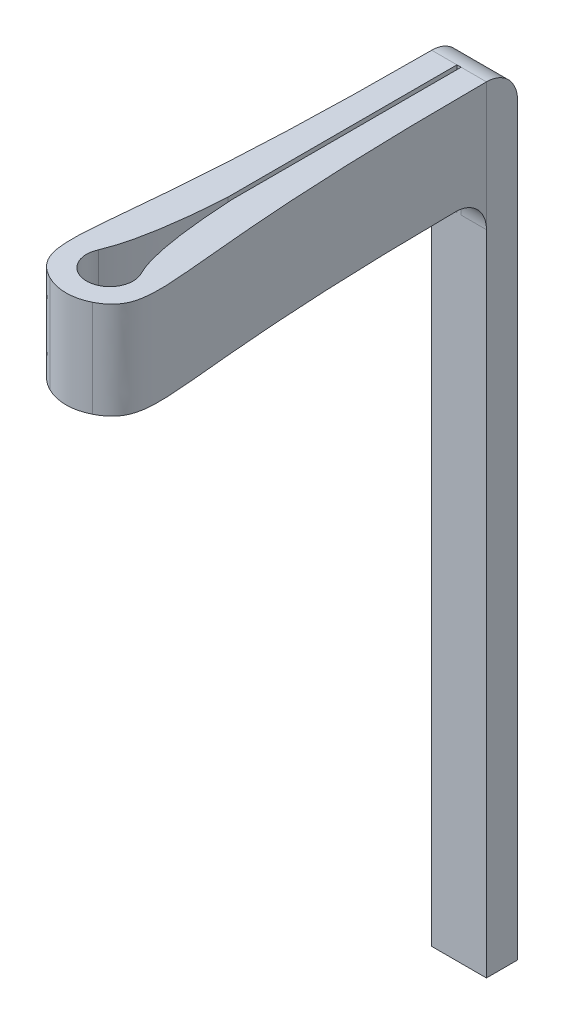
ISO-10303-21;
HEADER;
FILE_DESCRIPTION(('STEP AP214'),'2;1');
FILE_NAME('part.step','',(''),(''),'','','');
FILE_SCHEMA(('AUTOMOTIVE_DESIGN { 1 0 10303 214 1 1 1 1 }'));
ENDSEC;
DATA;
#1=APPLICATION_CONTEXT('core data for automotive mechanical design processes');
#2=APPLICATION_PROTOCOL_DEFINITION('international standard','automotive_design',2000,#1);
#3=PRODUCT_CONTEXT('',#1,'mechanical');
#4=PRODUCT('Part','Part','',(#3));
#5=PRODUCT_RELATED_PRODUCT_CATEGORY('part','',(#4));
#6=PRODUCT_DEFINITION_FORMATION('','',#4);
#7=PRODUCT_DEFINITION_CONTEXT('part definition',#1,'design');
#8=PRODUCT_DEFINITION('design','',#6,#7);
#9=PRODUCT_DEFINITION_SHAPE('','',#8);
#10=(LENGTH_UNIT() NAMED_UNIT(*) SI_UNIT(.MILLI.,.METRE.));
#11=(NAMED_UNIT(*) PLANE_ANGLE_UNIT() SI_UNIT($,.RADIAN.));
#12=(NAMED_UNIT(*) SI_UNIT($,.STERADIAN.) SOLID_ANGLE_UNIT());
#13=UNCERTAINTY_MEASURE_WITH_UNIT(LENGTH_MEASURE(1.E-05),#10,'distance_accuracy_value','');
#14=(GEOMETRIC_REPRESENTATION_CONTEXT(3) GLOBAL_UNCERTAINTY_ASSIGNED_CONTEXT((#13)) GLOBAL_UNIT_ASSIGNED_CONTEXT((#10,
#11,#12)) REPRESENTATION_CONTEXT('',''));
#15=CARTESIAN_POINT('',(0.,0.,0.));
#16=DIRECTION('',(0.,0.,1.));
#17=DIRECTION('',(1.,0.,0.));
#18=AXIS2_PLACEMENT_3D('',#15,#16,#17);
#19=CARTESIAN_POINT('',(0.895808533337032,-1.5875,-13.7148715300879));
#20=CARTESIAN_POINT('',(0.895808533337031,-1.5875,-4.54222595975247));
#21=CARTESIAN_POINT('',(1.58866877369205,-1.5875,-2.21931302735155));
#22=CARTESIAN_POINT('',(2.08819617284586,-1.5875,-1.33769603441971));
#23=CARTESIAN_POINT('',(0.,-1.5875,-0.766240153873851));
#24=B_SPLINE_CURVE_WITH_KNOTS('',4,(#19,#20,#21,#22,#23),.UNSPECIFIED.,.F.,.F.,(5,5),(0.,1.),.UNSPECIFIED.);
#25=DIRECTION('',(0.,1.,0.));
#26=VECTOR('',#25,1.);
#27=SURFACE_OF_LINEAR_EXTRUSION('',#24,#26);
#28=CARTESIAN_POINT('',(0.895808533337032,1.5875,-13.7148715300879));
#29=CARTESIAN_POINT('',(0.895808533337031,1.5875,-4.54222595975247));
#30=CARTESIAN_POINT('',(1.58866877369205,1.5875,-2.21931302735155));
#31=CARTESIAN_POINT('',(2.08819617284586,1.5875,-1.33769603441971));
#32=CARTESIAN_POINT('',(0.,1.5875,-0.766240153873851));
#33=B_SPLINE_CURVE_WITH_KNOTS('',4,(#28,#29,#30,#31,#32),.UNSPECIFIED.,.F.,.F.,(5,5),(0.,1.),.UNSPECIFIED.);
#34=CARTESIAN_POINT('',(0.895808533337032,1.5875,-13.7148715300879));
#35=VERTEX_POINT('',#34);
#36=CARTESIAN_POINT('',(0.693616128821132,1.5875,-1.02051237814192));
#37=VERTEX_POINT('',#36);
#38=EDGE_CURVE('E182',#35,#37,#33,.T.);
#39=ORIENTED_EDGE('',*,*,#38,.T.);
#40=DIRECTION('',(0.,1.,0.));
#41=VECTOR('',#40,1.);
#42=CARTESIAN_POINT('',(0.693616128821133,1.5875,-1.02051237814192));
#43=LINE('',#42,#41);
#44=CARTESIAN_POINT('',(0.693616128821132,-1.5875,-1.02051237814192));
#45=VERTEX_POINT('',#44);
#46=EDGE_CURVE('E316',#37,#45,#43,.F.);
#47=ORIENTED_EDGE('',*,*,#46,.T.);
#48=CARTESIAN_POINT('',(0.899123413075562,-1.5875,-12.6988715300887));
#49=VERTEX_POINT('',#48);
#50=EDGE_CURVE('E220',#49,#45,#24,.T.);
#51=ORIENTED_EDGE('',*,*,#50,.F.);
#52=CARTESIAN_POINT('',(0.899123413084522,-1.5875,-12.6988715300879));
#53=CARTESIAN_POINT('',(0.898933128711052,-1.58750020345704,-12.7274556913153));
#54=CARTESIAN_POINT('',(0.898751550135297,-1.588707043984,-12.7560262069104));
#55=CARTESIAN_POINT('',(0.898406314253751,-1.59352166634173,-12.8129629464484));
#56=CARTESIAN_POINT('',(0.898242656112615,-1.59712933620436,-12.8413291798562));
#57=CARTESIAN_POINT('',(0.897779810976951,-1.61151941722774,-12.9257670168045));
#58=CARTESIAN_POINT('',(0.897508122225242,-1.62586899450502,-12.9812732267905));
#59=CARTESIAN_POINT('',(0.897037413433582,-1.66368223177585,-13.0890872621627));
#60=CARTESIAN_POINT('',(0.896838428424054,-1.68715027405968,-13.1413935356636));
#61=CARTESIAN_POINT('',(0.896505476626066,-1.74253414258107,-13.2413232897363));
#62=CARTESIAN_POINT('',(0.896371498383278,-1.77444847903125,-13.2889475941009));
#63=CARTESIAN_POINT('',(0.896156730382232,-1.84581454495091,-13.3781613587182));
#64=CARTESIAN_POINT('',(0.896075945195192,-1.88526692183634,-13.4197503000745));
#65=CARTESIAN_POINT('',(0.895953480385962,-1.97061995173144,-13.4957270318787));
#66=CARTESIAN_POINT('',(0.895911800135447,-2.01652050112037,-13.5301149380236));
#67=CARTESIAN_POINT('',(0.89586807991464,-2.08917779055579,-13.5755407561251));
#68=CARTESIAN_POINT('',(0.895856638218661,-2.11405325433365,-13.5896657358438));
#69=CARTESIAN_POINT('',(0.895838452615409,-2.16488028841855,-13.6157599986209));
#70=CARTESIAN_POINT('',(0.895831704538102,-2.19083088175075,-13.6277311881789));
#71=CARTESIAN_POINT('',(0.895816263451206,-2.27005515466774,-13.6602878609003));
#72=CARTESIAN_POINT('',(0.895812349793979,-2.32475190267935,-13.6775480073459));
#73=CARTESIAN_POINT('',(0.895809171928931,-2.41706043780761,-13.6983260460475));
#74=CARTESIAN_POINT('',(0.895808773736024,-2.45410086402192,-13.7045265647462));
#75=CARTESIAN_POINT('',(0.895808530960212,-2.52858669157816,-13.7127976228349));
#76=CARTESIAN_POINT('',(0.895808685591698,-2.56603144290336,-13.7148740164188));
#77=CARTESIAN_POINT('',(0.895808533337032,-2.6035,-13.7148715300879));
#78=B_SPLINE_CURVE_WITH_KNOTS('',3,(#52,#53,#54,#55,#56,#57,#58,#59,#60,#61,#62,#63,#64,#65,#66,
#67,#68,#69,#70,#71,#72,#73,#74,#75,#76,#77),.UNSPECIFIED.,.F.,.F.,(4,2,2,2,2,2,2,2,2,2,2,2,4),
(0.,0.0857016931933246,0.171399389773151,0.34251201259806,0.513706973244693,0.684871758017355,
0.856051250148908,1.02722799177784,1.11295702741115,1.19860979969476,1.36973870794013,
1.48219984882806,1.59450123675989),.UNSPECIFIED.);
#79=CARTESIAN_POINT('',(0.895808533337032,-2.6035,-13.7148715300879));
#80=VERTEX_POINT('',#79);
#81=EDGE_CURVE('E365',#49,#80,#78,.T.);
#82=ORIENTED_EDGE('',*,*,#81,.T.);
#83=DIRECTION('',(0.,1.,0.));
#84=VECTOR('',#83,1.);
#85=CARTESIAN_POINT('',(0.895808533337032,-1.5875,-13.7148715300879));
#86=LINE('',#85,#84);
#87=EDGE_CURVE('E56',#80,#35,#86,.T.);
#88=ORIENTED_EDGE('',*,*,#87,.T.);
#89=EDGE_LOOP('',(#39,#47,#51,#82,#88));
#90=FACE_BOUND('',#89,.T.);
#91=ADVANCED_FACE('F35',(#90),#27,.F.);
#92=CARTESIAN_POINT('',(-0.895808533337031,-1.5875,-13.7148715300879));
#93=CARTESIAN_POINT('',(-0.895808533337032,-1.5875,-4.54222595975247));
#94=CARTESIAN_POINT('',(-1.58866877369205,-1.5875,-2.21931302735155));
#95=CARTESIAN_POINT('',(-2.08819617284586,-1.5875,-1.33769603441971));
#96=CARTESIAN_POINT('',(0.,-1.5875,-0.766240153873851));
#97=B_SPLINE_CURVE_WITH_KNOTS('',4,(#92,#93,#94,#95,#96),.UNSPECIFIED.,.F.,.F.,(5,5),(0.,1.),.UNSPECIFIED.);
#98=DIRECTION('',(0.,1.,0.));
#99=VECTOR('',#98,1.);
#100=SURFACE_OF_LINEAR_EXTRUSION('',#97,#99);
#101=DIRECTION('',(0.,1.,0.));
#102=VECTOR('',#101,1.);
#103=CARTESIAN_POINT('',(-0.895808533337031,-1.5875,-13.7148715300879));
#104=LINE('',#103,#102);
#105=CARTESIAN_POINT('',(-0.895808533337031,-2.6035,-13.7148715300879));
#106=VERTEX_POINT('',#105);
#107=CARTESIAN_POINT('',(-0.895808533337031,1.5875,-13.7148715300879));
#108=VERTEX_POINT('',#107);
#109=EDGE_CURVE('E339',#106,#108,#104,.T.);
#110=ORIENTED_EDGE('',*,*,#109,.F.);
#111=CARTESIAN_POINT('',(-0.895808533337031,-2.6035,-13.7148715300879));
#112=CARTESIAN_POINT('',(-0.895808577092861,-2.57491510973712,-13.7148713264985));
#113=CARTESIAN_POINT('',(-0.895808528511462,-2.54634392472514,-13.7136644246977));
#114=CARTESIAN_POINT('',(-0.895808618861333,-2.48940597123118,-13.7088495859276));
#115=CARTESIAN_POINT('',(-0.895808757783834,-2.46103919325167,-13.7052417612511));
#116=CARTESIAN_POINT('',(-0.895810012620951,-2.37659991581095,-13.6908511195006));
#117=CARTESIAN_POINT('',(-0.895811964296557,-2.32109299299045,-13.6765010398288));
#118=CARTESIAN_POINT('',(-0.895825408633093,-2.21327798056724,-13.6386867257066));
#119=CARTESIAN_POINT('',(-0.89583690587852,-2.16097144099123,-13.6152181147369));
#120=CARTESIAN_POINT('',(-0.895880803790064,-2.06104143824503,-13.5598331272013));
#121=CARTESIAN_POINT('',(-0.895913200775506,-2.01341715218015,-13.5279182387011));
#122=CARTESIAN_POINT('',(-0.896012599209308,-1.92420325438186,-13.4565508369797));
#123=CARTESIAN_POINT('',(-0.896079603922931,-1.88261421255246,-13.4170976127324));
#124=CARTESIAN_POINT('',(-0.896262655081279,-1.80663757824133,-13.3317429175017));
#125=CARTESIAN_POINT('',(-0.896378700732181,-1.77224986920574,-13.2858415509017));
#126=CARTESIAN_POINT('',(-0.896598868812494,-1.72682476343896,-13.2131834856075));
#127=CARTESIAN_POINT('',(-0.89668002622306,-1.71270016513127,-13.1883080182779));
#128=CARTESIAN_POINT('',(-0.896858870784934,-1.68660666976522,-13.1374810649115));
#129=CARTESIAN_POINT('',(-0.896956543167485,-1.67463586621497,-13.1115305557651));
#130=CARTESIAN_POINT('',(-0.89727611608098,-1.64208033890623,-13.0323066807575));
#131=CARTESIAN_POINT('',(-0.897524718601109,-1.62482094452539,-12.9776103988227));
#132=CARTESIAN_POINT('',(-0.897997890996059,-1.60404416344566,-12.8853037582438));
#133=CARTESIAN_POINT('',(-0.898201479605004,-1.5978441225871,-12.848264630884));
#134=CARTESIAN_POINT('',(-0.898639493602371,-1.58957372507961,-12.7737816456367));
#135=CARTESIAN_POINT('',(-0.8988738747654,-1.58749751329236,-12.736338437585));
#136=CARTESIAN_POINT('',(-0.899123413075567,-1.5875,-12.6988715300878));
#137=B_SPLINE_CURVE_WITH_KNOTS('',3,(#111,#112,#113,#114,#115,#116,#117,#118,#119,#120,#121,
#122,#123,#124,#125,#126,#127,#128,#129,#130,#131,#132,#133,#134,#135,#136),.UNSPECIFIED.,.F.,
.F.,(4,2,2,2,2,2,2,2,2,2,2,2,4),(0.,0.0857019762667672,0.171399944476704,0.342513086760776,
0.513708457954163,0.684873687991979,0.856055070543598,1.02723368230345,1.11296249946954,
1.19861505396577,1.36974355203272,1.48220228529057,1.59450123174176),.UNSPECIFIED.);
#138=CARTESIAN_POINT('',(-0.899123413075567,-1.5875,-12.6988715300878));
#139=VERTEX_POINT('',#138);
#140=EDGE_CURVE('E11',#106,#139,#137,.T.);
#141=ORIENTED_EDGE('',*,*,#140,.T.);
#142=CARTESIAN_POINT('',(-0.693616128821139,-1.5875,-1.02051237814192));
#143=VERTEX_POINT('',#142);
#144=EDGE_CURVE('E243',#139,#143,#97,.T.);
#145=ORIENTED_EDGE('',*,*,#144,.T.);
#146=DIRECTION('',(0.,1.,0.));
#147=VECTOR('',#146,1.);
#148=CARTESIAN_POINT('',(-0.693616128821141,-1.5875,-1.02051237814192));
#149=LINE('',#148,#147);
#150=CARTESIAN_POINT('',(-0.693616128821139,1.5875,-1.02051237814192));
#151=VERTEX_POINT('',#150);
#152=EDGE_CURVE('E331',#143,#151,#149,.T.);
#153=ORIENTED_EDGE('',*,*,#152,.T.);
#154=CARTESIAN_POINT('',(-0.895808533337031,1.5875,-13.7148715300879));
#155=CARTESIAN_POINT('',(-0.895808533337032,1.5875,-4.54222595975247));
#156=CARTESIAN_POINT('',(-1.58866877369205,1.5875,-2.21931302735155));
#157=CARTESIAN_POINT('',(-2.08819617284586,1.5875,-1.33769603441971));
#158=CARTESIAN_POINT('',(0.,1.5875,-0.766240153873851));
#159=B_SPLINE_CURVE_WITH_KNOTS('',4,(#154,#155,#156,#157,#158),.UNSPECIFIED.,.F.,.F.,(5,5),(0.,
1.),.UNSPECIFIED.);
#160=EDGE_CURVE('E215',#108,#151,#159,.T.);
#161=ORIENTED_EDGE('',*,*,#160,.F.);
#162=EDGE_LOOP('',(#110,#141,#145,#153,#161));
#163=FACE_BOUND('',#162,.T.);
#164=ADVANCED_FACE('F261',(#163),#100,.T.);
#165=CARTESIAN_POINT('',(-0.0682967636124148,-1.5875,0.));
#166=DIRECTION('',(-1.,0.,0.));
#167=DIRECTION('',(0.,0.,1.));
#168=AXIS2_PLACEMENT_3D('',#165,#166,#167);
#169=PLANE('',#168);
#170=DIRECTION('',(0.,1.,0.));
#171=VECTOR('',#170,1.);
#172=CARTESIAN_POINT('',(-0.0682967636124164,-1.5875,-13.7148715300879));
#173=LINE('',#172,#171);
#174=CARTESIAN_POINT('',(-0.0682967636124164,-2.6035,-13.7148715300879));
#175=VERTEX_POINT('',#174);
#176=CARTESIAN_POINT('',(-0.0682967636124159,1.5875,-13.7148715300879));
#177=VERTEX_POINT('',#176);
#178=EDGE_CURVE('E255',#175,#177,#173,.T.);
#179=ORIENTED_EDGE('',*,*,#178,.T.);
#180=DIRECTION('',(0.,0.,1.));
#181=VECTOR('',#180,1.);
#182=CARTESIAN_POINT('',(-0.0682967636124148,1.5875,0.));
#183=LINE('',#182,#181);
#184=CARTESIAN_POINT('',(-0.0682967636124155,1.5875,-6.21461869480893));
#185=VERTEX_POINT('',#184);
#186=EDGE_CURVE('E209',#177,#185,#183,.T.);
#187=ORIENTED_EDGE('',*,*,#186,.T.);
#188=DIRECTION('',(0.,1.,0.));
#189=VECTOR('',#188,1.);
#190=CARTESIAN_POINT('',(-0.0682967636124155,-1.5875,-6.21461869480893));
#191=LINE('',#190,#189);
#192=CARTESIAN_POINT('',(-0.0682967636124155,-1.5875,-6.21461869480893));
#193=VERTEX_POINT('',#192);
#194=EDGE_CURVE('E392',#193,#185,#191,.T.);
#195=ORIENTED_EDGE('',*,*,#194,.F.);
#196=DIRECTION('',(0.,0.,1.));
#197=VECTOR('',#196,1.);
#198=CARTESIAN_POINT('',(-0.0682967636124148,-1.5875,0.));
#199=LINE('',#198,#197);
#200=CARTESIAN_POINT('',(-0.0682967636124163,-1.5875,-12.6988715300879));
#201=VERTEX_POINT('',#200);
#202=EDGE_CURVE('E246',#201,#193,#199,.T.);
#203=ORIENTED_EDGE('',*,*,#202,.F.);
#204=CARTESIAN_POINT('',(-0.0682967636124163,-2.6035,-12.6988715300879));
#205=DIRECTION('',(-1.,0.,0.));
#206=DIRECTION('',(0.,0.,1.));
#207=AXIS2_PLACEMENT_3D('',#204,#205,#206);
#208=CIRCLE('',#207,1.016);
#209=EDGE_CURVE('E49',#201,#175,#208,.T.);
#210=ORIENTED_EDGE('',*,*,#209,.T.);
#211=EDGE_LOOP('',(#179,#187,#195,#203,#210));
#212=FACE_BOUND('',#211,.T.);
#213=ADVANCED_FACE('F266',(#212),#169,.F.);
#214=CARTESIAN_POINT('',(-0.69080742229309,-1.5875,-2.60647548731597));
#215=CARTESIAN_POINT('',(-0.217222133422871,-1.5875,-3.73873423608694));
#216=CARTESIAN_POINT('',(-0.0682967636124155,-1.5875,-6.21461869480893));
#217=B_SPLINE_CURVE_WITH_KNOTS('',2,(#214,#215,#216),.UNSPECIFIED.,.F.,.F.,(3,3),(0.,1.),.UNSPECIFIED.);
#218=DIRECTION('',(0.,1.,0.));
#219=VECTOR('',#218,1.);
#220=SURFACE_OF_LINEAR_EXTRUSION('',#217,#219);
#221=ORIENTED_EDGE('',*,*,#194,.T.);
#222=CARTESIAN_POINT('',(-0.69080742229309,1.5875,-2.60647548731597));
#223=CARTESIAN_POINT('',(-0.217222133422871,1.5875,-3.73873423608694));
#224=CARTESIAN_POINT('',(-0.0682967636124155,1.5875,-6.21461869480893));
#225=B_SPLINE_CURVE_WITH_KNOTS('',2,(#222,#223,#224),.UNSPECIFIED.,.F.,.F.,(3,3),(0.,1.),.UNSPECIFIED.);
#226=CARTESIAN_POINT('',(-0.69080742229309,1.5875,-2.60647548731597));
#227=VERTEX_POINT('',#226);
#228=EDGE_CURVE('E204',#227,#185,#225,.T.);
#229=ORIENTED_EDGE('',*,*,#228,.F.);
#230=DIRECTION('',(0.,1.,0.));
#231=VECTOR('',#230,1.);
#232=CARTESIAN_POINT('',(-0.69080742229309,-1.5875,-2.60647548731597));
#233=LINE('',#232,#231);
#234=CARTESIAN_POINT('',(-0.69080742229309,-1.5875,-2.60647548731597));
#235=VERTEX_POINT('',#234);
#236=EDGE_CURVE('E391',#235,#227,#233,.T.);
#237=ORIENTED_EDGE('',*,*,#236,.F.);
#238=EDGE_CURVE('E279',#235,#193,#217,.T.);
#239=ORIENTED_EDGE('',*,*,#238,.T.);
#240=EDGE_LOOP('',(#221,#229,#237,#239));
#241=FACE_BOUND('',#240,.T.);
#242=ADVANCED_FACE('F272',(#241),#220,.T.);
#243=CARTESIAN_POINT('',(0.,-1.5875,-2.28487153008787));
#244=DIRECTION('',(0.,1.,0.));
#245=DIRECTION('',(0.,0.,1.));
#246=AXIS2_PLACEMENT_3D('',#243,#244,#245);
#247=CYLINDRICAL_SURFACE('',#246,0.762);
#248=ORIENTED_EDGE('',*,*,#236,.T.);
#249=CARTESIAN_POINT('',(0.,1.5875,-2.28487153008787));
#250=DIRECTION('',(0.,1.,0.));
#251=DIRECTION('',(0.,0.,1.));
#252=AXIS2_PLACEMENT_3D('',#249,#250,#251);
#253=CIRCLE('',#252,0.762);
#254=CARTESIAN_POINT('',(0.69080742229309,1.5875,-2.60647548731597));
#255=VERTEX_POINT('',#254);
#256=EDGE_CURVE('E198',#227,#255,#253,.T.);
#257=ORIENTED_EDGE('',*,*,#256,.T.);
#258=DIRECTION('',(0.,1.,0.));
#259=VECTOR('',#258,1.);
#260=CARTESIAN_POINT('',(0.69080742229309,-1.5875,-2.60647548731597));
#261=LINE('',#260,#259);
#262=CARTESIAN_POINT('',(0.69080742229309,-1.5875,-2.60647548731597));
#263=VERTEX_POINT('',#262);
#264=EDGE_CURVE('E389',#263,#255,#261,.T.);
#265=ORIENTED_EDGE('',*,*,#264,.F.);
#266=CARTESIAN_POINT('',(0.,-1.5875,-2.28487153008787));
#267=DIRECTION('',(0.,1.,0.));
#268=DIRECTION('',(0.,0.,1.));
#269=AXIS2_PLACEMENT_3D('',#266,#267,#268);
#270=CIRCLE('',#269,0.762);
#271=EDGE_CURVE('E285',#235,#263,#270,.T.);
#272=ORIENTED_EDGE('',*,*,#271,.F.);
#273=EDGE_LOOP('',(#248,#257,#265,#272));
#274=FACE_BOUND('',#273,.T.);
#275=ADVANCED_FACE('F276',(#274),#247,.F.);
#276=CARTESIAN_POINT('',(0.69080742229309,-1.5875,-2.60647548731597));
#277=CARTESIAN_POINT('',(0.218071276463601,-1.5875,-3.48213292446278));
#278=CARTESIAN_POINT('',(0.0682967636124155,-1.5875,-6.21461869480893));
#279=B_SPLINE_CURVE_WITH_KNOTS('',2,(#276,#277,#278),.UNSPECIFIED.,.F.,.F.,(3,3),(0.,1.),.UNSPECIFIED.);
#280=DIRECTION('',(0.,1.,0.));
#281=VECTOR('',#280,1.);
#282=SURFACE_OF_LINEAR_EXTRUSION('',#279,#281);
#283=ORIENTED_EDGE('',*,*,#264,.T.);
#284=CARTESIAN_POINT('',(0.69080742229309,1.5875,-2.60647548731597));
#285=CARTESIAN_POINT('',(0.218071276463601,1.5875,-3.48213292446278));
#286=CARTESIAN_POINT('',(0.0682967636124155,1.5875,-6.21461869480893));
#287=B_SPLINE_CURVE_WITH_KNOTS('',2,(#284,#285,#286),.UNSPECIFIED.,.F.,.F.,(3,3),(0.,1.),.UNSPECIFIED.);
#288=CARTESIAN_POINT('',(0.0682967636124155,1.5875,-6.21461869480893));
#289=VERTEX_POINT('',#288);
#290=EDGE_CURVE('E193',#255,#289,#287,.T.);
#291=ORIENTED_EDGE('',*,*,#290,.T.);
#292=DIRECTION('',(0.,1.,0.));
#293=VECTOR('',#292,1.);
#294=CARTESIAN_POINT('',(0.0682967636124155,-1.5875,-6.21461869480893));
#295=LINE('',#294,#293);
#296=CARTESIAN_POINT('',(0.0682967636124155,-1.5875,-6.21461869480893));
#297=VERTEX_POINT('',#296);
#298=EDGE_CURVE('E387',#297,#289,#295,.T.);
#299=ORIENTED_EDGE('',*,*,#298,.F.);
#300=EDGE_CURVE('E289',#263,#297,#279,.T.);
#301=ORIENTED_EDGE('',*,*,#300,.F.);
#302=EDGE_LOOP('',(#283,#291,#299,#301));
#303=FACE_BOUND('',#302,.T.);
#304=ADVANCED_FACE('F297',(#303),#282,.F.);
#305=CARTESIAN_POINT('',(0.0682967636124148,-1.5875,0.));
#306=DIRECTION('',(-1.,0.,0.));
#307=DIRECTION('',(0.,0.,1.));
#308=AXIS2_PLACEMENT_3D('',#305,#306,#307);
#309=PLANE('',#308);
#310=ORIENTED_EDGE('',*,*,#298,.T.);
#311=DIRECTION('',(0.,0.,1.));
#312=VECTOR('',#311,1.);
#313=CARTESIAN_POINT('',(0.0682967636124148,1.5875,0.));
#314=LINE('',#313,#312);
#315=CARTESIAN_POINT('',(0.0682967636124164,1.5875,-13.7148715300879));
#316=VERTEX_POINT('',#315);
#317=EDGE_CURVE('E187',#316,#289,#314,.T.);
#318=ORIENTED_EDGE('',*,*,#317,.F.);
#319=DIRECTION('',(0.,1.,0.));
#320=VECTOR('',#319,1.);
#321=CARTESIAN_POINT('',(0.0682967636124164,-1.5875,-13.7148715300879));
#322=LINE('',#321,#320);
#323=CARTESIAN_POINT('',(0.0682967636124164,-2.6035,-13.7148715300879));
#324=VERTEX_POINT('',#323);
#325=EDGE_CURVE('E336',#324,#316,#322,.T.);
#326=ORIENTED_EDGE('',*,*,#325,.F.);
#327=CARTESIAN_POINT('',(0.0682967636124163,-2.6035,-12.6988715300879));
#328=DIRECTION('',(-1.,0.,0.));
#329=DIRECTION('',(0.,0.,1.));
#330=AXIS2_PLACEMENT_3D('',#327,#328,#329);
#331=CIRCLE('',#330,1.016);
#332=CARTESIAN_POINT('',(0.0682967636124163,-1.5875,-12.6988715300879));
#333=VERTEX_POINT('',#332);
#334=EDGE_CURVE('E363',#324,#333,#331,.F.);
#335=ORIENTED_EDGE('',*,*,#334,.T.);
#336=DIRECTION('',(0.,0.,1.));
#337=VECTOR('',#336,1.);
#338=CARTESIAN_POINT('',(0.0682967636124148,-1.5875,0.));
#339=LINE('',#338,#337);
#340=EDGE_CURVE('E228',#333,#297,#339,.T.);
#341=ORIENTED_EDGE('',*,*,#340,.T.);
#342=EDGE_LOOP('',(#310,#318,#326,#335,#341));
#343=FACE_BOUND('',#342,.T.);
#344=ADVANCED_FACE('F299',(#343),#309,.T.);
#345=CARTESIAN_POINT('',(0.,-1.5875,0.));
#346=DIRECTION('',(0.,1.,0.));
#347=DIRECTION('',(0.,0.,1.));
#348=AXIS2_PLACEMENT_3D('',#345,#346,#347);
#349=PLANE('',#348);
#350=ORIENTED_EDGE('',*,*,#340,.F.);
#351=DIRECTION('',(-1.,0.,0.));
#352=VECTOR('',#351,1.);
#353=CARTESIAN_POINT('',(0.,-1.5875,-12.6988715300879));
#354=LINE('',#353,#352);
#355=EDGE_CURVE('E346',#333,#49,#354,.F.);
#356=ORIENTED_EDGE('',*,*,#355,.T.);
#357=ORIENTED_EDGE('',*,*,#50,.T.);
#358=CARTESIAN_POINT('',(0.,-1.5875,-2.37752109802517));
#359=DIRECTION('',(0.,1.,0.));
#360=DIRECTION('',(0.,0.,1.));
#361=AXIS2_PLACEMENT_3D('',#358,#359,#360);
#362=CIRCLE('',#361,1.524);
#363=EDGE_CURVE('E328',#45,#143,#362,.F.);
#364=ORIENTED_EDGE('',*,*,#363,.T.);
#365=ORIENTED_EDGE('',*,*,#144,.F.);
#366=DIRECTION('',(1.,0.,0.));
#367=VECTOR('',#366,1.);
#368=CARTESIAN_POINT('',(0.,-1.5875,-12.6988715300879));
#369=LINE('',#368,#367);
#370=EDGE_CURVE('E247',#139,#201,#369,.T.);
#371=ORIENTED_EDGE('',*,*,#370,.T.);
#372=ORIENTED_EDGE('',*,*,#202,.T.);
#373=ORIENTED_EDGE('',*,*,#238,.F.);
#374=ORIENTED_EDGE('',*,*,#271,.T.);
#375=ORIENTED_EDGE('',*,*,#300,.T.);
#376=EDGE_LOOP('',(#350,#356,#357,#364,#365,#371,#372,#373,#374,#375));
#377=FACE_BOUND('',#376,.T.);
#378=ADVANCED_FACE('F268',(#377),#349,.F.);
#379=CARTESIAN_POINT('',(0.,1.5875,0.));
#380=DIRECTION('',(0.,1.,0.));
#381=DIRECTION('',(0.,0.,1.));
#382=AXIS2_PLACEMENT_3D('',#379,#380,#381);
#383=PLANE('',#382);
#384=ORIENTED_EDGE('',*,*,#38,.F.);
#385=DIRECTION('',(-1.,0.,0.));
#386=VECTOR('',#385,1.);
#387=CARTESIAN_POINT('',(0.,1.5875,-13.7148715300879));
#388=LINE('',#387,#386);
#389=EDGE_CURVE('E353',#35,#316,#388,.T.);
#390=ORIENTED_EDGE('',*,*,#389,.T.);
#391=ORIENTED_EDGE('',*,*,#317,.T.);
#392=ORIENTED_EDGE('',*,*,#290,.F.);
#393=ORIENTED_EDGE('',*,*,#256,.F.);
#394=ORIENTED_EDGE('',*,*,#228,.T.);
#395=ORIENTED_EDGE('',*,*,#186,.F.);
#396=DIRECTION('',(-1.,0.,0.));
#397=VECTOR('',#396,1.);
#398=CARTESIAN_POINT('',(0.,1.5875,-13.7148715300879));
#399=LINE('',#398,#397);
#400=EDGE_CURVE('E350',#177,#108,#399,.T.);
#401=ORIENTED_EDGE('',*,*,#400,.T.);
#402=ORIENTED_EDGE('',*,*,#160,.T.);
#403=CARTESIAN_POINT('',(0.,1.5875,-2.37752109802517));
#404=DIRECTION('',(0.,1.,0.));
#405=DIRECTION('',(0.,0.,1.));
#406=AXIS2_PLACEMENT_3D('',#403,#404,#405);
#407=CIRCLE('',#406,1.524);
#408=EDGE_CURVE('E325',#151,#37,#407,.T.);
#409=ORIENTED_EDGE('',*,*,#408,.T.);
#410=EDGE_LOOP('',(#384,#390,#391,#392,#393,#394,#395,#401,#402,#409));
#411=FACE_BOUND('',#410,.T.);
#412=ADVANCED_FACE('F306',(#411),#383,.T.);
#413=CARTESIAN_POINT('',(0.,0.,-2.37752109802517));
#414=DIRECTION('',(0.,1.,0.));
#415=DIRECTION('',(0.,0.,1.));
#416=AXIS2_PLACEMENT_3D('',#413,#414,#415);
#417=CYLINDRICAL_SURFACE('',#416,1.524);
#418=ORIENTED_EDGE('',*,*,#363,.F.);
#419=ORIENTED_EDGE('',*,*,#46,.F.);
#420=ORIENTED_EDGE('',*,*,#408,.F.);
#421=ORIENTED_EDGE('',*,*,#152,.F.);
#422=EDGE_LOOP('',(#418,#419,#420,#421));
#423=FACE_BOUND('',#422,.T.);
#424=ADVANCED_FACE('F323',(#423),#417,.T.);
#425=CARTESIAN_POINT('',(0.895808533337032,0.,-13.7148715300879));
#426=DIRECTION('',(0.,0.,1.));
#427=DIRECTION('',(1.,0.,0.));
#428=AXIS2_PLACEMENT_3D('',#425,#426,#427);
#429=PLANE('',#428);
#430=DIRECTION('',(0.,1.,0.));
#431=VECTOR('',#430,1.);
#432=CARTESIAN_POINT('',(0.895808533337032,0.,-13.7148715300879));
#433=LINE('',#432,#431);
#434=CARTESIAN_POINT('',(0.895808533337032,-23.8125,-13.7148715300879));
#435=VERTEX_POINT('',#434);
#436=EDGE_CURVE('E170',#435,#80,#433,.T.);
#437=ORIENTED_EDGE('',*,*,#436,.T.);
#438=DIRECTION('',(-1.,0.,0.));
#439=VECTOR('',#438,1.);
#440=CARTESIAN_POINT('',(0.895808533337032,-2.6035,-13.7148715300879));
#441=LINE('',#440,#439);
#442=EDGE_CURVE('E241',#80,#324,#441,.T.);
#443=ORIENTED_EDGE('',*,*,#442,.T.);
#444=ORIENTED_EDGE('',*,*,#325,.T.);
#445=DIRECTION('',(-1.,0.,0.));
#446=VECTOR('',#445,1.);
#447=CARTESIAN_POINT('',(0.895808533337032,1.5875,-13.7148715300879));
#448=LINE('',#447,#446);
#449=EDGE_CURVE('E151',#316,#177,#448,.T.);
#450=ORIENTED_EDGE('',*,*,#449,.T.);
#451=ORIENTED_EDGE('',*,*,#178,.F.);
#452=DIRECTION('',(1.,0.,0.));
#453=VECTOR('',#452,1.);
#454=CARTESIAN_POINT('',(0.895808533337032,-2.6035,-13.7148715300879));
#455=LINE('',#454,#453);
#456=EDGE_CURVE('E159',#175,#106,#455,.F.);
#457=ORIENTED_EDGE('',*,*,#456,.T.);
#458=DIRECTION('',(0.,1.,0.));
#459=VECTOR('',#458,1.);
#460=CARTESIAN_POINT('',(-0.895808533337031,0.,-13.7148715300879));
#461=LINE('',#460,#459);
#462=CARTESIAN_POINT('',(-0.895808533337031,-23.8125,-13.7148715300879));
#463=VERTEX_POINT('',#462);
#464=EDGE_CURVE('E156',#463,#106,#461,.T.);
#465=ORIENTED_EDGE('',*,*,#464,.F.);
#466=DIRECTION('',(-1.,0.,0.));
#467=VECTOR('',#466,1.);
#468=CARTESIAN_POINT('',(0.895808533337032,-23.8125,-13.7148715300879));
#469=LINE('',#468,#467);
#470=EDGE_CURVE('E142',#435,#463,#469,.T.);
#471=ORIENTED_EDGE('',*,*,#470,.F.);
#472=EDGE_LOOP('',(#437,#443,#444,#450,#451,#457,#465,#471));
#473=FACE_BOUND('',#472,.T.);
#474=ADVANCED_FACE('F157',(#473),#429,.T.);
#475=CARTESIAN_POINT('',(0.895808533337032,0.,-14.7308715300879));
#476=DIRECTION('',(0.,0.,-1.));
#477=DIRECTION('',(0.,1.,0.));
#478=AXIS2_PLACEMENT_3D('',#475,#476,#477);
#479=PLANE('',#478);
#480=DIRECTION('',(0.,-1.,0.));
#481=VECTOR('',#480,1.);
#482=CARTESIAN_POINT('',(-0.895808533337031,0.,-14.7308715300879));
#483=LINE('',#482,#481);
#484=CARTESIAN_POINT('',(-0.895808533337031,0.5715,-14.7308715300879));
#485=VERTEX_POINT('',#484);
#486=CARTESIAN_POINT('',(-0.895808533337031,-23.8125,-14.7308715300879));
#487=VERTEX_POINT('',#486);
#488=EDGE_CURVE('E163',#485,#487,#483,.T.);
#489=ORIENTED_EDGE('',*,*,#488,.F.);
#490=DIRECTION('',(-1.,0.,0.));
#491=VECTOR('',#490,1.);
#492=CARTESIAN_POINT('',(0.895808533337032,0.5715,-14.7308715300879));
#493=LINE('',#492,#491);
#494=CARTESIAN_POINT('',(0.895808533337032,0.5715,-14.7308715300879));
#495=VERTEX_POINT('',#494);
#496=EDGE_CURVE('E359',#485,#495,#493,.F.);
#497=ORIENTED_EDGE('',*,*,#496,.T.);
#498=DIRECTION('',(0.,-1.,0.));
#499=VECTOR('',#498,1.);
#500=CARTESIAN_POINT('',(0.895808533337032,0.,-14.7308715300879));
#501=LINE('',#500,#499);
#502=CARTESIAN_POINT('',(0.895808533337032,-23.8125,-14.7308715300879));
#503=VERTEX_POINT('',#502);
#504=EDGE_CURVE('E168',#495,#503,#501,.T.);
#505=ORIENTED_EDGE('',*,*,#504,.T.);
#506=DIRECTION('',(-1.,0.,0.));
#507=VECTOR('',#506,1.);
#508=CARTESIAN_POINT('',(0.895808533337032,-23.8125,-14.7308715300879));
#509=LINE('',#508,#507);
#510=EDGE_CURVE('E152',#503,#487,#509,.T.);
#511=ORIENTED_EDGE('',*,*,#510,.T.);
#512=EDGE_LOOP('',(#489,#497,#505,#511));
#513=FACE_BOUND('',#512,.T.);
#514=ADVANCED_FACE('F404',(#513),#479,.T.);
#515=CARTESIAN_POINT('',(0.895808533337032,-23.8125,0.));
#516=DIRECTION('',(0.,1.,0.));
#517=DIRECTION('',(0.,0.,1.));
#518=AXIS2_PLACEMENT_3D('',#515,#516,#517);
#519=PLANE('',#518);
#520=ORIENTED_EDGE('',*,*,#470,.T.);
#521=DIRECTION('',(0.,0.,-1.));
#522=VECTOR('',#521,1.);
#523=CARTESIAN_POINT('',(-0.895808533337031,-23.8125,0.));
#524=LINE('',#523,#522);
#525=EDGE_CURVE('E147',#463,#487,#524,.T.);
#526=ORIENTED_EDGE('',*,*,#525,.T.);
#527=ORIENTED_EDGE('',*,*,#510,.F.);
#528=DIRECTION('',(0.,0.,-1.));
#529=VECTOR('',#528,1.);
#530=CARTESIAN_POINT('',(0.895808533337032,-23.8125,0.));
#531=LINE('',#530,#529);
#532=EDGE_CURVE('E149',#435,#503,#531,.T.);
#533=ORIENTED_EDGE('',*,*,#532,.F.);
#534=EDGE_LOOP('',(#520,#526,#527,#533));
#535=FACE_BOUND('',#534,.T.);
#536=ADVANCED_FACE('F144',(#535),#519,.F.);
#537=CARTESIAN_POINT('',(0.895808533337032,0.,0.));
#538=DIRECTION('',(1.,0.,0.));
#539=DIRECTION('',(0.,0.,-1.));
#540=AXIS2_PLACEMENT_3D('',#537,#538,#539);
#541=PLANE('',#540);
#542=ORIENTED_EDGE('',*,*,#504,.F.);
#543=CARTESIAN_POINT('',(0.895808533337032,0.5715,-13.7148715300879));
#544=DIRECTION('',(1.,0.,0.));
#545=DIRECTION('',(0.,0.,-1.));
#546=AXIS2_PLACEMENT_3D('',#543,#544,#545);
#547=CIRCLE('',#546,1.016);
#548=EDGE_CURVE('E361',#495,#35,#547,.T.);
#549=ORIENTED_EDGE('',*,*,#548,.T.);
#550=ORIENTED_EDGE('',*,*,#87,.F.);
#551=ORIENTED_EDGE('',*,*,#436,.F.);
#552=ORIENTED_EDGE('',*,*,#532,.T.);
#553=EDGE_LOOP('',(#542,#549,#550,#551,#552));
#554=FACE_BOUND('',#553,.T.);
#555=ADVANCED_FACE('F406',(#554),#541,.T.);
#556=CARTESIAN_POINT('',(-0.895808533337031,0.,0.));
#557=DIRECTION('',(1.,0.,0.));
#558=DIRECTION('',(0.,0.,-1.));
#559=AXIS2_PLACEMENT_3D('',#556,#557,#558);
#560=PLANE('',#559);
#561=ORIENTED_EDGE('',*,*,#109,.T.);
#562=CARTESIAN_POINT('',(-0.895808533337031,0.5715,-13.7148715300879));
#563=DIRECTION('',(1.,0.,0.));
#564=DIRECTION('',(0.,0.,-1.));
#565=AXIS2_PLACEMENT_3D('',#562,#563,#564);
#566=CIRCLE('',#565,1.016);
#567=EDGE_CURVE('E357',#108,#485,#566,.F.);
#568=ORIENTED_EDGE('',*,*,#567,.T.);
#569=ORIENTED_EDGE('',*,*,#488,.T.);
#570=ORIENTED_EDGE('',*,*,#525,.F.);
#571=ORIENTED_EDGE('',*,*,#464,.T.);
#572=EDGE_LOOP('',(#561,#568,#569,#570,#571));
#573=FACE_BOUND('',#572,.T.);
#574=ADVANCED_FACE('F165',(#573),#560,.F.);
#575=CARTESIAN_POINT('',(0.895808533337032,-2.6035,-12.6988715300879));
#576=DIRECTION('',(-1.,0.,0.));
#577=DIRECTION('',(0.,0.,1.));
#578=AXIS2_PLACEMENT_3D('',#575,#576,#577);
#579=CYLINDRICAL_SURFACE('',#578,1.016);
#580=ORIENTED_EDGE('',*,*,#81,.F.);
#581=ORIENTED_EDGE('',*,*,#355,.F.);
#582=ORIENTED_EDGE('',*,*,#334,.F.);
#583=ORIENTED_EDGE('',*,*,#442,.F.);
#584=EDGE_LOOP('',(#580,#581,#582,#583));
#585=FACE_BOUND('',#584,.T.);
#586=ADVANCED_FACE('F371',(#585),#579,.F.);
#587=CARTESIAN_POINT('',(0.,-2.6035,-12.6988715300879));
#588=DIRECTION('',(1.,0.,0.));
#589=DIRECTION('',(0.,0.,-1.));
#590=AXIS2_PLACEMENT_3D('',#587,#588,#589);
#591=CYLINDRICAL_SURFACE('',#590,1.016);
#592=ORIENTED_EDGE('',*,*,#140,.F.);
#593=ORIENTED_EDGE('',*,*,#456,.F.);
#594=ORIENTED_EDGE('',*,*,#209,.F.);
#595=ORIENTED_EDGE('',*,*,#370,.F.);
#596=EDGE_LOOP('',(#592,#593,#594,#595));
#597=FACE_BOUND('',#596,.T.);
#598=ADVANCED_FACE('F374',(#597),#591,.F.);
#599=CARTESIAN_POINT('',(0.,0.5715,-13.7148715300879));
#600=DIRECTION('',(-1.,0.,0.));
#601=DIRECTION('',(0.,0.,1.));
#602=AXIS2_PLACEMENT_3D('',#599,#600,#601);
#603=CYLINDRICAL_SURFACE('',#602,1.016);
#604=ORIENTED_EDGE('',*,*,#548,.F.);
#605=ORIENTED_EDGE('',*,*,#496,.F.);
#606=ORIENTED_EDGE('',*,*,#567,.F.);
#607=ORIENTED_EDGE('',*,*,#400,.F.);
#608=ORIENTED_EDGE('',*,*,#449,.F.);
#609=ORIENTED_EDGE('',*,*,#389,.F.);
#610=EDGE_LOOP('',(#604,#605,#606,#607,#608,#609));
#611=FACE_BOUND('',#610,.T.);
#612=ADVANCED_FACE('F37',(#611),#603,.T.);
#613=CLOSED_SHELL('',(#91,#164,#213,#242,#275,#304,#344,#378,#412,#424,#474,#514,#536,#555,#574,
#586,#598,#612));
#614=MANIFOLD_SOLID_BREP('B2',#613);
#615=ADVANCED_BREP_SHAPE_REPRESENTATION('',(#18,#614),#14);
#616=SHAPE_DEFINITION_REPRESENTATION(#9,#615);
ENDSEC;
END-ISO-10303-21;
